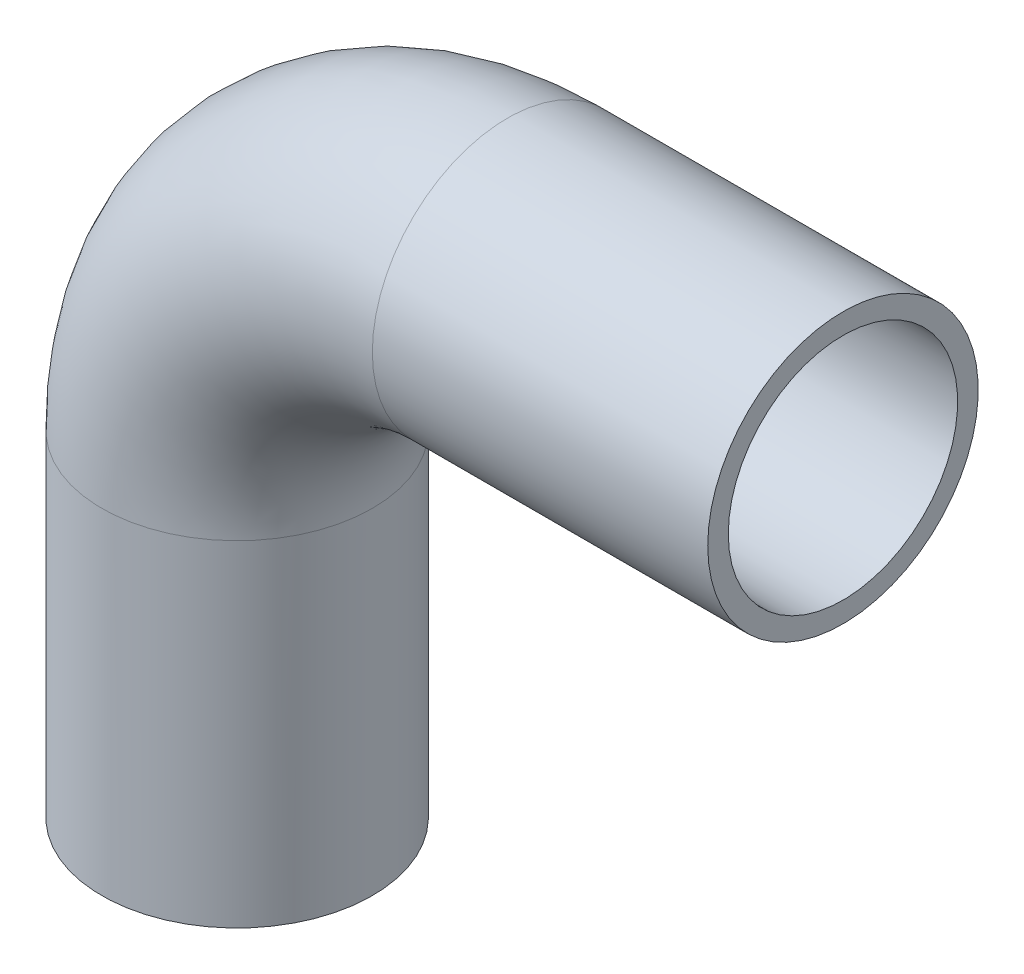
ISO-10303-21;
HEADER;
FILE_DESCRIPTION(('STEP AP214'),'2;1');
FILE_NAME('part.step','',(''),(''),'','','');
FILE_SCHEMA(('AUTOMOTIVE_DESIGN { 1 0 10303 214 1 1 1 1 }'));
ENDSEC;
DATA;
#1=APPLICATION_CONTEXT('core data for automotive mechanical design processes');
#2=APPLICATION_PROTOCOL_DEFINITION('international standard','automotive_design',2000,#1);
#3=PRODUCT_CONTEXT('',#1,'mechanical');
#4=PRODUCT('Part','Part','',(#3));
#5=PRODUCT_RELATED_PRODUCT_CATEGORY('part','',(#4));
#6=PRODUCT_DEFINITION_FORMATION('','',#4);
#7=PRODUCT_DEFINITION_CONTEXT('part definition',#1,'design');
#8=PRODUCT_DEFINITION('design','',#6,#7);
#9=PRODUCT_DEFINITION_SHAPE('','',#8);
#10=(LENGTH_UNIT() NAMED_UNIT(*) SI_UNIT(.MILLI.,.METRE.));
#11=(NAMED_UNIT(*) PLANE_ANGLE_UNIT() SI_UNIT($,.RADIAN.));
#12=(NAMED_UNIT(*) SI_UNIT($,.STERADIAN.) SOLID_ANGLE_UNIT());
#13=UNCERTAINTY_MEASURE_WITH_UNIT(LENGTH_MEASURE(1.E-05),#10,'distance_accuracy_value','');
#14=(GEOMETRIC_REPRESENTATION_CONTEXT(3) GLOBAL_UNCERTAINTY_ASSIGNED_CONTEXT((#13)) GLOBAL_UNIT_ASSIGNED_CONTEXT((#10,
#11,#12)) REPRESENTATION_CONTEXT('',''));
#15=CARTESIAN_POINT('',(0.,0.,0.));
#16=DIRECTION('',(0.,0.,1.));
#17=DIRECTION('',(1.,0.,0.));
#18=AXIS2_PLACEMENT_3D('',#15,#16,#17);
#19=CARTESIAN_POINT('',(25.,31.,0.));
#20=DIRECTION('',(0.,0.,1.));
#21=DIRECTION('',(1.,0.,0.));
#22=AXIS2_PLACEMENT_3D('',#19,#20,#21);
#23=TOROIDAL_SURFACE('',#22,25.,10.6);
#24=CARTESIAN_POINT('',(25.,56.,0.));
#25=DIRECTION('',(-1.,0.,0.));
#26=DIRECTION('',(0.,1.,0.));
#27=AXIS2_PLACEMENT_3D('',#24,#25,#26);
#28=CIRCLE('',#27,10.6);
#29=CARTESIAN_POINT('',(25.,66.6,0.));
#30=VERTEX_POINT('',#29);
#31=EDGE_CURVE('E33',#30,#30,#28,.T.);
#32=ORIENTED_EDGE('',*,*,#31,.F.);
#33=EDGE_LOOP('',(#32));
#34=FACE_BOUND('',#33,.T.);
#35=CARTESIAN_POINT('',(0.,31.,0.));
#36=DIRECTION('',(0.,-1.,0.));
#37=DIRECTION('',(-1.,0.,0.));
#38=AXIS2_PLACEMENT_3D('',#35,#36,#37);
#39=CIRCLE('',#38,10.6);
#40=CARTESIAN_POINT('',(-10.6,31.,0.));
#41=VERTEX_POINT('',#40);
#42=EDGE_CURVE('E31',#41,#41,#39,.F.);
#43=ORIENTED_EDGE('',*,*,#42,.F.);
#44=EDGE_LOOP('',(#43));
#45=FACE_BOUND('',#44,.T.);
#46=ADVANCED_FACE('F13',(#34,#45),#23,.F.);
#47=CARTESIAN_POINT('',(56.,56.,0.));
#48=DIRECTION('',(-1.,0.,0.));
#49=DIRECTION('',(0.,0.,1.));
#50=AXIS2_PLACEMENT_3D('',#47,#48,#49);
#51=CYLINDRICAL_SURFACE('',#50,10.6);
#52=CARTESIAN_POINT('',(56.,56.,0.));
#53=DIRECTION('',(-1.,0.,0.));
#54=DIRECTION('',(0.,0.,1.));
#55=AXIS2_PLACEMENT_3D('',#52,#53,#54);
#56=CIRCLE('',#55,10.6);
#57=CARTESIAN_POINT('',(56.,56.,10.6));
#58=VERTEX_POINT('',#57);
#59=EDGE_CURVE('E17',#58,#58,#56,.T.);
#60=ORIENTED_EDGE('',*,*,#59,.F.);
#61=EDGE_LOOP('',(#60));
#62=FACE_BOUND('',#61,.T.);
#63=ORIENTED_EDGE('',*,*,#31,.T.);
#64=EDGE_LOOP('',(#63));
#65=FACE_BOUND('',#64,.T.);
#66=ADVANCED_FACE('F52',(#62,#65),#51,.F.);
#67=CARTESIAN_POINT('',(0.,31.,0.));
#68=DIRECTION('',(0.,-1.,0.));
#69=DIRECTION('',(0.,0.,-1.));
#70=AXIS2_PLACEMENT_3D('',#67,#68,#69);
#71=CYLINDRICAL_SURFACE('',#70,10.6);
#72=ORIENTED_EDGE('',*,*,#42,.T.);
#73=EDGE_LOOP('',(#72));
#74=FACE_BOUND('',#73,.T.);
#75=CARTESIAN_POINT('',(0.,0.,0.));
#76=DIRECTION('',(0.,-1.,0.));
#77=DIRECTION('',(0.,0.,-1.));
#78=AXIS2_PLACEMENT_3D('',#75,#76,#77);
#79=CIRCLE('',#78,10.6);
#80=CARTESIAN_POINT('',(0.,0.,-10.6));
#81=VERTEX_POINT('',#80);
#82=EDGE_CURVE('E42',#81,#81,#79,.F.);
#83=ORIENTED_EDGE('',*,*,#82,.F.);
#84=EDGE_LOOP('',(#83));
#85=FACE_BOUND('',#84,.T.);
#86=ADVANCED_FACE('F55',(#74,#85),#71,.F.);
#87=CARTESIAN_POINT('',(56.,68.5,12.6500021082908));
#88=DIRECTION('',(1.,0.,0.));
#89=DIRECTION('',(0.,-1.,0.));
#90=AXIS2_PLACEMENT_3D('',#87,#88,#89);
#91=PLANE('',#90);
#92=ORIENTED_EDGE('',*,*,#59,.T.);
#93=EDGE_LOOP('',(#92));
#94=FACE_BOUND('',#93,.T.);
#95=CARTESIAN_POINT('',(56.,56.,0.));
#96=DIRECTION('',(-1.,0.,0.));
#97=DIRECTION('',(0.,0.,1.));
#98=AXIS2_PLACEMENT_3D('',#95,#96,#97);
#99=CIRCLE('',#98,12.5);
#100=CARTESIAN_POINT('',(56.,56.,12.5));
#101=VERTEX_POINT('',#100);
#102=EDGE_CURVE('E40',#101,#101,#99,.T.);
#103=ORIENTED_EDGE('',*,*,#102,.F.);
#104=EDGE_LOOP('',(#103));
#105=FACE_BOUND('',#104,.T.);
#106=ADVANCED_FACE('F49',(#94,#105),#91,.T.);
#107=CARTESIAN_POINT('',(12.5,0.,12.6500021083317));
#108=DIRECTION('',(0.,-1.,0.));
#109=DIRECTION('',(-1.,0.,0.));
#110=AXIS2_PLACEMENT_3D('',#107,#108,#109);
#111=PLANE('',#110);
#112=ORIENTED_EDGE('',*,*,#82,.T.);
#113=EDGE_LOOP('',(#112));
#114=FACE_BOUND('',#113,.T.);
#115=CARTESIAN_POINT('',(0.,0.,0.));
#116=DIRECTION('',(0.,-1.,0.));
#117=DIRECTION('',(0.,0.,-1.));
#118=AXIS2_PLACEMENT_3D('',#115,#116,#117);
#119=CIRCLE('',#118,12.5);
#120=CARTESIAN_POINT('',(0.,0.,-12.5));
#121=VERTEX_POINT('',#120);
#122=EDGE_CURVE('E26',#121,#121,#119,.F.);
#123=ORIENTED_EDGE('',*,*,#122,.F.);
#124=EDGE_LOOP('',(#123));
#125=FACE_BOUND('',#124,.T.);
#126=ADVANCED_FACE('F69',(#114,#125),#111,.T.);
#127=CARTESIAN_POINT('',(25.,56.,0.));
#128=DIRECTION('',(-1.,0.,0.));
#129=DIRECTION('',(0.,0.,1.));
#130=AXIS2_PLACEMENT_3D('',#127,#128,#129);
#131=CYLINDRICAL_SURFACE('',#130,12.5);
#132=ORIENTED_EDGE('',*,*,#102,.T.);
#133=EDGE_LOOP('',(#132));
#134=FACE_BOUND('',#133,.T.);
#135=CARTESIAN_POINT('',(25.,56.,0.));
#136=DIRECTION('',(-1.,0.,0.));
#137=DIRECTION('',(0.,-1.,0.));
#138=AXIS2_PLACEMENT_3D('',#135,#136,#137);
#139=CIRCLE('',#138,12.5);
#140=CARTESIAN_POINT('',(25.,43.5,0.));
#141=VERTEX_POINT('',#140);
#142=EDGE_CURVE('E21',#141,#141,#139,.T.);
#143=ORIENTED_EDGE('',*,*,#142,.F.);
#144=EDGE_LOOP('',(#143));
#145=FACE_BOUND('',#144,.T.);
#146=ADVANCED_FACE('F79',(#134,#145),#131,.T.);
#147=CARTESIAN_POINT('',(0.,0.,0.));
#148=DIRECTION('',(0.,-1.,0.));
#149=DIRECTION('',(0.,0.,-1.));
#150=AXIS2_PLACEMENT_3D('',#147,#148,#149);
#151=CYLINDRICAL_SURFACE('',#150,12.5);
#152=CARTESIAN_POINT('',(0.,31.,0.));
#153=DIRECTION('',(0.,-1.,0.));
#154=DIRECTION('',(1.,0.,0.));
#155=AXIS2_PLACEMENT_3D('',#152,#153,#154);
#156=CIRCLE('',#155,12.5);
#157=CARTESIAN_POINT('',(12.5,31.,0.));
#158=VERTEX_POINT('',#157);
#159=EDGE_CURVE('E8',#158,#158,#156,.F.);
#160=ORIENTED_EDGE('',*,*,#159,.F.);
#161=EDGE_LOOP('',(#160));
#162=FACE_BOUND('',#161,.T.);
#163=ORIENTED_EDGE('',*,*,#122,.T.);
#164=EDGE_LOOP('',(#163));
#165=FACE_BOUND('',#164,.T.);
#166=ADVANCED_FACE('F73',(#162,#165),#151,.T.);
#167=CARTESIAN_POINT('',(25.,31.,0.));
#168=DIRECTION('',(0.,0.,1.));
#169=DIRECTION('',(1.,0.,0.));
#170=AXIS2_PLACEMENT_3D('',#167,#168,#169);
#171=TOROIDAL_SURFACE('',#170,25.,12.5);
#172=ORIENTED_EDGE('',*,*,#142,.T.);
#173=EDGE_LOOP('',(#172));
#174=FACE_BOUND('',#173,.T.);
#175=ORIENTED_EDGE('',*,*,#159,.T.);
#176=EDGE_LOOP('',(#175));
#177=FACE_BOUND('',#176,.T.);
#178=ADVANCED_FACE('F71',(#174,#177),#171,.T.);
#179=CLOSED_SHELL('',(#46,#66,#86,#106,#126,#146,#166,#178));
#180=MANIFOLD_SOLID_BREP('B1',#179);
#181=ADVANCED_BREP_SHAPE_REPRESENTATION('',(#18,#180),#14);
#182=SHAPE_DEFINITION_REPRESENTATION(#9,#181);
ENDSEC;
END-ISO-10303-21;
